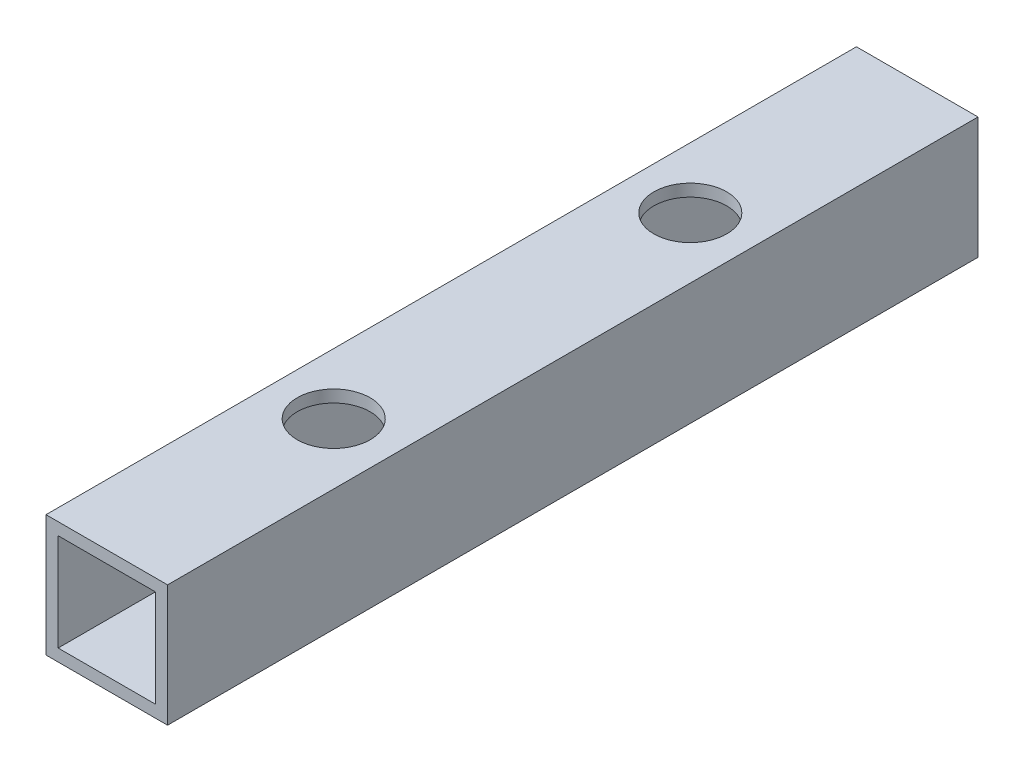
ISO-10303-21;
HEADER;
FILE_DESCRIPTION(('STEP AP214'),'2;1');
FILE_NAME('part.step','',(''),(''),'','','');
FILE_SCHEMA(('AUTOMOTIVE_DESIGN { 1 0 10303 214 1 1 1 1 }'));
ENDSEC;
DATA;
#1=APPLICATION_CONTEXT('core data for automotive mechanical design processes');
#2=APPLICATION_PROTOCOL_DEFINITION('international standard','automotive_design',2000,#1);
#3=PRODUCT_CONTEXT('',#1,'mechanical');
#4=PRODUCT('Part','Part','',(#3));
#5=PRODUCT_RELATED_PRODUCT_CATEGORY('part','',(#4));
#6=PRODUCT_DEFINITION_FORMATION('','',#4);
#7=PRODUCT_DEFINITION_CONTEXT('part definition',#1,'design');
#8=PRODUCT_DEFINITION('design','',#6,#7);
#9=PRODUCT_DEFINITION_SHAPE('','',#8);
#10=(LENGTH_UNIT() NAMED_UNIT(*) SI_UNIT(.MILLI.,.METRE.));
#11=(NAMED_UNIT(*) PLANE_ANGLE_UNIT() SI_UNIT($,.RADIAN.));
#12=(NAMED_UNIT(*) SI_UNIT($,.STERADIAN.) SOLID_ANGLE_UNIT());
#13=UNCERTAINTY_MEASURE_WITH_UNIT(LENGTH_MEASURE(1.E-05),#10,'distance_accuracy_value','');
#14=(GEOMETRIC_REPRESENTATION_CONTEXT(3) GLOBAL_UNCERTAINTY_ASSIGNED_CONTEXT((#13)) GLOBAL_UNIT_ASSIGNED_CONTEXT((#10,
#11,#12)) REPRESENTATION_CONTEXT('',''));
#15=CARTESIAN_POINT('',(0.,0.,0.));
#16=DIRECTION('',(0.,0.,1.));
#17=DIRECTION('',(1.,0.,0.));
#18=AXIS2_PLACEMENT_3D('',#15,#16,#17);
#19=CARTESIAN_POINT('',(0.,0.,100.));
#20=DIRECTION('',(0.,0.,1.));
#21=DIRECTION('',(1.,0.,0.));
#22=AXIS2_PLACEMENT_3D('',#19,#20,#21);
#23=PLANE('',#22);
#24=DIRECTION('',(0.,1.,0.));
#25=VECTOR('',#24,1.);
#26=CARTESIAN_POINT('',(7.5,7.5,100.));
#27=LINE('',#26,#25);
#28=CARTESIAN_POINT('',(7.5,-7.5,100.));
#29=VERTEX_POINT('',#28);
#30=CARTESIAN_POINT('',(7.5,7.5,100.));
#31=VERTEX_POINT('',#30);
#32=EDGE_CURVE('E138',#29,#31,#27,.T.);
#33=ORIENTED_EDGE('',*,*,#32,.T.);
#34=DIRECTION('',(-1.,0.,0.));
#35=VECTOR('',#34,1.);
#36=CARTESIAN_POINT('',(-7.5,7.5,100.));
#37=LINE('',#36,#35);
#38=CARTESIAN_POINT('',(-7.5,7.5,100.));
#39=VERTEX_POINT('',#38);
#40=EDGE_CURVE('E141',#31,#39,#37,.T.);
#41=ORIENTED_EDGE('',*,*,#40,.T.);
#42=DIRECTION('',(0.,-1.,0.));
#43=VECTOR('',#42,1.);
#44=CARTESIAN_POINT('',(-7.5,7.5,100.));
#45=LINE('',#44,#43);
#46=CARTESIAN_POINT('',(-7.5,-7.5,100.));
#47=VERTEX_POINT('',#46);
#48=EDGE_CURVE('E144',#39,#47,#45,.T.);
#49=ORIENTED_EDGE('',*,*,#48,.T.);
#50=DIRECTION('',(1.,0.,0.));
#51=VECTOR('',#50,1.);
#52=CARTESIAN_POINT('',(-7.5,-7.5,100.));
#53=LINE('',#52,#51);
#54=EDGE_CURVE('E146',#47,#29,#53,.T.);
#55=ORIENTED_EDGE('',*,*,#54,.T.);
#56=EDGE_LOOP('',(#33,#41,#49,#55));
#57=FACE_BOUND('',#56,.T.);
#58=DIRECTION('',(-1.,0.,0.));
#59=VECTOR('',#58,1.);
#60=CARTESIAN_POINT('',(-6.,6.,100.));
#61=LINE('',#60,#59);
#62=CARTESIAN_POINT('',(6.,6.,100.));
#63=VERTEX_POINT('',#62);
#64=CARTESIAN_POINT('',(-6.,6.,100.));
#65=VERTEX_POINT('',#64);
#66=EDGE_CURVE('E108',#63,#65,#61,.T.);
#67=ORIENTED_EDGE('',*,*,#66,.F.);
#68=DIRECTION('',(0.,1.,0.));
#69=VECTOR('',#68,1.);
#70=CARTESIAN_POINT('',(6.,6.,100.));
#71=LINE('',#70,#69);
#72=CARTESIAN_POINT('',(6.,-6.,100.));
#73=VERTEX_POINT('',#72);
#74=EDGE_CURVE('E100',#73,#63,#71,.T.);
#75=ORIENTED_EDGE('',*,*,#74,.F.);
#76=DIRECTION('',(1.,0.,0.));
#77=VECTOR('',#76,1.);
#78=CARTESIAN_POINT('',(-6.,-6.,100.));
#79=LINE('',#78,#77);
#80=CARTESIAN_POINT('',(-6.,-6.,100.));
#81=VERTEX_POINT('',#80);
#82=EDGE_CURVE('E122',#81,#73,#79,.T.);
#83=ORIENTED_EDGE('',*,*,#82,.F.);
#84=DIRECTION('',(0.,-1.,0.));
#85=VECTOR('',#84,1.);
#86=CARTESIAN_POINT('',(-6.,6.,100.));
#87=LINE('',#86,#85);
#88=EDGE_CURVE('E120',#65,#81,#87,.T.);
#89=ORIENTED_EDGE('',*,*,#88,.F.);
#90=EDGE_LOOP('',(#67,#75,#83,#89));
#91=FACE_BOUND('',#90,.T.);
#92=ADVANCED_FACE('F33',(#57,#91),#23,.T.);
#93=CARTESIAN_POINT('',(0.,0.,0.));
#94=DIRECTION('',(0.,0.,1.));
#95=DIRECTION('',(1.,0.,0.));
#96=AXIS2_PLACEMENT_3D('',#93,#94,#95);
#97=PLANE('',#96);
#98=DIRECTION('',(0.,1.,0.));
#99=VECTOR('',#98,1.);
#100=CARTESIAN_POINT('',(7.5,7.5,0.));
#101=LINE('',#100,#99);
#102=CARTESIAN_POINT('',(7.5,-7.5,0.));
#103=VERTEX_POINT('',#102);
#104=CARTESIAN_POINT('',(7.5,7.5,0.));
#105=VERTEX_POINT('',#104);
#106=EDGE_CURVE('E116',#103,#105,#101,.T.);
#107=ORIENTED_EDGE('',*,*,#106,.F.);
#108=DIRECTION('',(1.,0.,0.));
#109=VECTOR('',#108,1.);
#110=CARTESIAN_POINT('',(-7.5,-7.5,0.));
#111=LINE('',#110,#109);
#112=CARTESIAN_POINT('',(-7.5,-7.5,0.));
#113=VERTEX_POINT('',#112);
#114=EDGE_CURVE('E142',#113,#103,#111,.T.);
#115=ORIENTED_EDGE('',*,*,#114,.F.);
#116=DIRECTION('',(0.,-1.,0.));
#117=VECTOR('',#116,1.);
#118=CARTESIAN_POINT('',(-7.5,7.5,0.));
#119=LINE('',#118,#117);
#120=CARTESIAN_POINT('',(-7.5,7.5,0.));
#121=VERTEX_POINT('',#120);
#122=EDGE_CURVE('E153',#121,#113,#119,.T.);
#123=ORIENTED_EDGE('',*,*,#122,.F.);
#124=DIRECTION('',(-1.,0.,0.));
#125=VECTOR('',#124,1.);
#126=CARTESIAN_POINT('',(-7.5,7.5,0.));
#127=LINE('',#126,#125);
#128=EDGE_CURVE('E151',#105,#121,#127,.T.);
#129=ORIENTED_EDGE('',*,*,#128,.F.);
#130=EDGE_LOOP('',(#107,#115,#123,#129));
#131=FACE_BOUND('',#130,.T.);
#132=DIRECTION('',(0.,1.,0.));
#133=VECTOR('',#132,1.);
#134=CARTESIAN_POINT('',(6.,6.,0.));
#135=LINE('',#134,#133);
#136=CARTESIAN_POINT('',(6.,-6.,0.));
#137=VERTEX_POINT('',#136);
#138=CARTESIAN_POINT('',(6.,6.,0.));
#139=VERTEX_POINT('',#138);
#140=EDGE_CURVE('E58',#137,#139,#135,.T.);
#141=ORIENTED_EDGE('',*,*,#140,.T.);
#142=DIRECTION('',(-1.,0.,0.));
#143=VECTOR('',#142,1.);
#144=CARTESIAN_POINT('',(-6.,6.,0.));
#145=LINE('',#144,#143);
#146=CARTESIAN_POINT('',(-6.,6.,0.));
#147=VERTEX_POINT('',#146);
#148=EDGE_CURVE('E115',#139,#147,#145,.T.);
#149=ORIENTED_EDGE('',*,*,#148,.T.);
#150=DIRECTION('',(0.,-1.,0.));
#151=VECTOR('',#150,1.);
#152=CARTESIAN_POINT('',(-6.,6.,0.));
#153=LINE('',#152,#151);
#154=CARTESIAN_POINT('',(-6.,-6.,0.));
#155=VERTEX_POINT('',#154);
#156=EDGE_CURVE('E130',#147,#155,#153,.T.);
#157=ORIENTED_EDGE('',*,*,#156,.T.);
#158=DIRECTION('',(1.,0.,0.));
#159=VECTOR('',#158,1.);
#160=CARTESIAN_POINT('',(-6.,-6.,0.));
#161=LINE('',#160,#159);
#162=EDGE_CURVE('E109',#155,#137,#161,.T.);
#163=ORIENTED_EDGE('',*,*,#162,.T.);
#164=EDGE_LOOP('',(#141,#149,#157,#163));
#165=FACE_BOUND('',#164,.T.);
#166=ADVANCED_FACE('F207',(#131,#165),#97,.F.);
#167=CARTESIAN_POINT('',(7.5,7.5,100.));
#168=DIRECTION('',(-1.,0.,0.));
#169=DIRECTION('',(0.,-1.,0.));
#170=AXIS2_PLACEMENT_3D('',#167,#168,#169);
#171=PLANE('',#170);
#172=ORIENTED_EDGE('',*,*,#106,.T.);
#173=DIRECTION('',(0.,0.,-1.));
#174=VECTOR('',#173,1.);
#175=CARTESIAN_POINT('',(7.5,7.5,100.));
#176=LINE('',#175,#174);
#177=EDGE_CURVE('E11',#31,#105,#176,.T.);
#178=ORIENTED_EDGE('',*,*,#177,.F.);
#179=ORIENTED_EDGE('',*,*,#32,.F.);
#180=DIRECTION('',(0.,0.,-1.));
#181=VECTOR('',#180,1.);
#182=CARTESIAN_POINT('',(7.5,-7.5,100.));
#183=LINE('',#182,#181);
#184=EDGE_CURVE('E148',#29,#103,#183,.T.);
#185=ORIENTED_EDGE('',*,*,#184,.T.);
#186=EDGE_LOOP('',(#172,#178,#179,#185));
#187=FACE_BOUND('',#186,.T.);
#188=ADVANCED_FACE('F35',(#187),#171,.F.);
#189=CARTESIAN_POINT('',(-7.5,7.5,100.));
#190=DIRECTION('',(0.,-1.,0.));
#191=DIRECTION('',(0.,0.,-1.));
#192=AXIS2_PLACEMENT_3D('',#189,#190,#191);
#193=PLANE('',#192);
#194=CARTESIAN_POINT('',(0.,7.5,72.));
#195=DIRECTION('',(0.,1.,0.));
#196=DIRECTION('',(0.,0.,1.));
#197=AXIS2_PLACEMENT_3D('',#194,#195,#196);
#198=CIRCLE('',#197,4.5);
#199=CARTESIAN_POINT('',(0.,7.5,76.5));
#200=VERTEX_POINT('',#199);
#201=EDGE_CURVE('E165',#200,#200,#198,.T.);
#202=ORIENTED_EDGE('',*,*,#201,.F.);
#203=EDGE_LOOP('',(#202));
#204=FACE_BOUND('',#203,.T.);
#205=CARTESIAN_POINT('',(0.,7.5,28.));
#206=DIRECTION('',(0.,1.,0.));
#207=DIRECTION('',(0.,0.,1.));
#208=AXIS2_PLACEMENT_3D('',#205,#206,#207);
#209=CIRCLE('',#208,4.5);
#210=CARTESIAN_POINT('',(0.,7.5,32.5));
#211=VERTEX_POINT('',#210);
#212=EDGE_CURVE('E172',#211,#211,#209,.T.);
#213=ORIENTED_EDGE('',*,*,#212,.F.);
#214=EDGE_LOOP('',(#213));
#215=FACE_BOUND('',#214,.T.);
#216=ORIENTED_EDGE('',*,*,#128,.T.);
#217=DIRECTION('',(0.,0.,-1.));
#218=VECTOR('',#217,1.);
#219=CARTESIAN_POINT('',(-7.5,7.5,100.));
#220=LINE('',#219,#218);
#221=EDGE_CURVE('E42',#39,#121,#220,.T.);
#222=ORIENTED_EDGE('',*,*,#221,.F.);
#223=ORIENTED_EDGE('',*,*,#40,.F.);
#224=ORIENTED_EDGE('',*,*,#177,.T.);
#225=EDGE_LOOP('',(#216,#222,#223,#224));
#226=FACE_BOUND('',#225,.T.);
#227=ADVANCED_FACE('F222',(#204,#215,#226),#193,.F.);
#228=CARTESIAN_POINT('',(-7.5,7.5,100.));
#229=DIRECTION('',(1.,0.,0.));
#230=DIRECTION('',(0.,1.,0.));
#231=AXIS2_PLACEMENT_3D('',#228,#229,#230);
#232=PLANE('',#231);
#233=ORIENTED_EDGE('',*,*,#122,.T.);
#234=DIRECTION('',(0.,0.,-1.));
#235=VECTOR('',#234,1.);
#236=CARTESIAN_POINT('',(-7.5,-7.5,100.));
#237=LINE('',#236,#235);
#238=EDGE_CURVE('E158',#47,#113,#237,.T.);
#239=ORIENTED_EDGE('',*,*,#238,.F.);
#240=ORIENTED_EDGE('',*,*,#48,.F.);
#241=ORIENTED_EDGE('',*,*,#221,.T.);
#242=EDGE_LOOP('',(#233,#239,#240,#241));
#243=FACE_BOUND('',#242,.T.);
#244=ADVANCED_FACE('F220',(#243),#232,.F.);
#245=CARTESIAN_POINT('',(-7.5,-7.5,100.));
#246=DIRECTION('',(0.,1.,0.));
#247=DIRECTION('',(0.,0.,1.));
#248=AXIS2_PLACEMENT_3D('',#245,#246,#247);
#249=PLANE('',#248);
#250=CARTESIAN_POINT('',(0.,-7.5,72.));
#251=DIRECTION('',(0.,1.,0.));
#252=DIRECTION('',(0.,0.,1.));
#253=AXIS2_PLACEMENT_3D('',#250,#251,#252);
#254=CIRCLE('',#253,4.5);
#255=CARTESIAN_POINT('',(0.,-7.5,76.5));
#256=VERTEX_POINT('',#255);
#257=EDGE_CURVE('E128',#256,#256,#254,.T.);
#258=ORIENTED_EDGE('',*,*,#257,.T.);
#259=EDGE_LOOP('',(#258));
#260=FACE_BOUND('',#259,.T.);
#261=CARTESIAN_POINT('',(0.,-7.5,28.));
#262=DIRECTION('',(0.,1.,0.));
#263=DIRECTION('',(0.,0.,1.));
#264=AXIS2_PLACEMENT_3D('',#261,#262,#263);
#265=CIRCLE('',#264,4.5);
#266=CARTESIAN_POINT('',(0.,-7.5,32.5));
#267=VERTEX_POINT('',#266);
#268=EDGE_CURVE('E169',#267,#267,#265,.T.);
#269=ORIENTED_EDGE('',*,*,#268,.T.);
#270=EDGE_LOOP('',(#269));
#271=FACE_BOUND('',#270,.T.);
#272=ORIENTED_EDGE('',*,*,#114,.T.);
#273=ORIENTED_EDGE('',*,*,#184,.F.);
#274=ORIENTED_EDGE('',*,*,#54,.F.);
#275=ORIENTED_EDGE('',*,*,#238,.T.);
#276=EDGE_LOOP('',(#272,#273,#274,#275));
#277=FACE_BOUND('',#276,.T.);
#278=ADVANCED_FACE('F186',(#260,#271,#277),#249,.F.);
#279=CARTESIAN_POINT('',(6.,6.,100.));
#280=DIRECTION('',(-1.,0.,0.));
#281=DIRECTION('',(0.,-1.,0.));
#282=AXIS2_PLACEMENT_3D('',#279,#280,#281);
#283=PLANE('',#282);
#284=ORIENTED_EDGE('',*,*,#140,.F.);
#285=DIRECTION('',(0.,0.,-1.));
#286=VECTOR('',#285,1.);
#287=CARTESIAN_POINT('',(6.,-6.,100.));
#288=LINE('',#287,#286);
#289=EDGE_CURVE('E104',#73,#137,#288,.T.);
#290=ORIENTED_EDGE('',*,*,#289,.F.);
#291=ORIENTED_EDGE('',*,*,#74,.T.);
#292=DIRECTION('',(0.,0.,-1.));
#293=VECTOR('',#292,1.);
#294=CARTESIAN_POINT('',(6.,6.,100.));
#295=LINE('',#294,#293);
#296=EDGE_CURVE('E103',#63,#139,#295,.T.);
#297=ORIENTED_EDGE('',*,*,#296,.T.);
#298=EDGE_LOOP('',(#284,#290,#291,#297));
#299=FACE_BOUND('',#298,.T.);
#300=ADVANCED_FACE('F102',(#299),#283,.T.);
#301=CARTESIAN_POINT('',(-6.,6.,100.));
#302=DIRECTION('',(0.,-1.,0.));
#303=DIRECTION('',(0.,0.,-1.));
#304=AXIS2_PLACEMENT_3D('',#301,#302,#303);
#305=PLANE('',#304);
#306=CARTESIAN_POINT('',(0.,6.,72.));
#307=DIRECTION('',(0.,-1.,0.));
#308=DIRECTION('',(0.,0.,-1.));
#309=AXIS2_PLACEMENT_3D('',#306,#307,#308);
#310=CIRCLE('',#309,4.5);
#311=CARTESIAN_POINT('',(0.,6.,67.5));
#312=VERTEX_POINT('',#311);
#313=EDGE_CURVE('E181',#312,#312,#310,.T.);
#314=ORIENTED_EDGE('',*,*,#313,.F.);
#315=EDGE_LOOP('',(#314));
#316=FACE_BOUND('',#315,.T.);
#317=CARTESIAN_POINT('',(0.,6.,28.));
#318=DIRECTION('',(0.,-1.,0.));
#319=DIRECTION('',(0.,0.,-1.));
#320=AXIS2_PLACEMENT_3D('',#317,#318,#319);
#321=CIRCLE('',#320,4.5);
#322=CARTESIAN_POINT('',(0.,6.,23.5));
#323=VERTEX_POINT('',#322);
#324=EDGE_CURVE('E164',#323,#323,#321,.T.);
#325=ORIENTED_EDGE('',*,*,#324,.F.);
#326=EDGE_LOOP('',(#325));
#327=FACE_BOUND('',#326,.T.);
#328=ORIENTED_EDGE('',*,*,#148,.F.);
#329=ORIENTED_EDGE('',*,*,#296,.F.);
#330=ORIENTED_EDGE('',*,*,#66,.T.);
#331=DIRECTION('',(0.,0.,-1.));
#332=VECTOR('',#331,1.);
#333=CARTESIAN_POINT('',(-6.,6.,100.));
#334=LINE('',#333,#332);
#335=EDGE_CURVE('E117',#65,#147,#334,.T.);
#336=ORIENTED_EDGE('',*,*,#335,.T.);
#337=EDGE_LOOP('',(#328,#329,#330,#336));
#338=FACE_BOUND('',#337,.T.);
#339=ADVANCED_FACE('F112',(#316,#327,#338),#305,.T.);
#340=CARTESIAN_POINT('',(-6.,6.,100.));
#341=DIRECTION('',(1.,0.,0.));
#342=DIRECTION('',(0.,1.,0.));
#343=AXIS2_PLACEMENT_3D('',#340,#341,#342);
#344=PLANE('',#343);
#345=ORIENTED_EDGE('',*,*,#156,.F.);
#346=ORIENTED_EDGE('',*,*,#335,.F.);
#347=ORIENTED_EDGE('',*,*,#88,.T.);
#348=DIRECTION('',(0.,0.,-1.));
#349=VECTOR('',#348,1.);
#350=CARTESIAN_POINT('',(-6.,-6.,100.));
#351=LINE('',#350,#349);
#352=EDGE_CURVE('E50',#81,#155,#351,.T.);
#353=ORIENTED_EDGE('',*,*,#352,.T.);
#354=EDGE_LOOP('',(#345,#346,#347,#353));
#355=FACE_BOUND('',#354,.T.);
#356=ADVANCED_FACE('F247',(#355),#344,.T.);
#357=CARTESIAN_POINT('',(-6.,-6.,100.));
#358=DIRECTION('',(0.,1.,0.));
#359=DIRECTION('',(0.,0.,1.));
#360=AXIS2_PLACEMENT_3D('',#357,#358,#359);
#361=PLANE('',#360);
#362=CARTESIAN_POINT('',(0.,-6.,72.));
#363=DIRECTION('',(0.,1.,0.));
#364=DIRECTION('',(0.,0.,1.));
#365=AXIS2_PLACEMENT_3D('',#362,#363,#364);
#366=CIRCLE('',#365,4.5);
#367=CARTESIAN_POINT('',(0.,-6.,76.5));
#368=VERTEX_POINT('',#367);
#369=EDGE_CURVE('E37',#368,#368,#366,.T.);
#370=ORIENTED_EDGE('',*,*,#369,.F.);
#371=EDGE_LOOP('',(#370));
#372=FACE_BOUND('',#371,.T.);
#373=CARTESIAN_POINT('',(0.,-6.,28.));
#374=DIRECTION('',(0.,1.,0.));
#375=DIRECTION('',(0.,0.,1.));
#376=AXIS2_PLACEMENT_3D('',#373,#374,#375);
#377=CIRCLE('',#376,4.5);
#378=CARTESIAN_POINT('',(0.,-6.,32.5));
#379=VERTEX_POINT('',#378);
#380=EDGE_CURVE('E162',#379,#379,#377,.T.);
#381=ORIENTED_EDGE('',*,*,#380,.F.);
#382=EDGE_LOOP('',(#381));
#383=FACE_BOUND('',#382,.T.);
#384=ORIENTED_EDGE('',*,*,#162,.F.);
#385=ORIENTED_EDGE('',*,*,#352,.F.);
#386=ORIENTED_EDGE('',*,*,#82,.T.);
#387=ORIENTED_EDGE('',*,*,#289,.T.);
#388=EDGE_LOOP('',(#384,#385,#386,#387));
#389=FACE_BOUND('',#388,.T.);
#390=ADVANCED_FACE('F202',(#372,#383,#389),#361,.T.);
#391=CARTESIAN_POINT('',(0.,-52.5,28.));
#392=DIRECTION('',(0.,1.,0.));
#393=DIRECTION('',(0.,0.,1.));
#394=AXIS2_PLACEMENT_3D('',#391,#392,#393);
#395=CYLINDRICAL_SURFACE('',#394,4.5);
#396=ORIENTED_EDGE('',*,*,#380,.T.);
#397=EDGE_LOOP('',(#396));
#398=FACE_BOUND('',#397,.T.);
#399=ORIENTED_EDGE('',*,*,#268,.F.);
#400=EDGE_LOOP('',(#399));
#401=FACE_BOUND('',#400,.T.);
#402=ADVANCED_FACE('F192',(#398,#401),#395,.F.);
#403=CARTESIAN_POINT('',(0.,-52.5,72.));
#404=DIRECTION('',(0.,1.,0.));
#405=DIRECTION('',(0.,0.,1.));
#406=AXIS2_PLACEMENT_3D('',#403,#404,#405);
#407=CYLINDRICAL_SURFACE('',#406,4.5);
#408=ORIENTED_EDGE('',*,*,#369,.T.);
#409=EDGE_LOOP('',(#408));
#410=FACE_BOUND('',#409,.T.);
#411=ORIENTED_EDGE('',*,*,#257,.F.);
#412=EDGE_LOOP('',(#411));
#413=FACE_BOUND('',#412,.T.);
#414=ADVANCED_FACE('F189',(#410,#413),#407,.F.);
#415=ORIENTED_EDGE('',*,*,#324,.T.);
#416=EDGE_LOOP('',(#415));
#417=FACE_BOUND('',#416,.T.);
#418=ORIENTED_EDGE('',*,*,#212,.T.);
#419=EDGE_LOOP('',(#418));
#420=FACE_BOUND('',#419,.T.);
#421=ADVANCED_FACE('F191',(#417,#420),#395,.F.);
#422=ORIENTED_EDGE('',*,*,#313,.T.);
#423=EDGE_LOOP('',(#422));
#424=FACE_BOUND('',#423,.T.);
#425=ORIENTED_EDGE('',*,*,#201,.T.);
#426=EDGE_LOOP('',(#425));
#427=FACE_BOUND('',#426,.T.);
#428=ADVANCED_FACE('F195',(#424,#427),#407,.F.);
#429=CLOSED_SHELL('',(#92,#166,#188,#227,#244,#278,#300,#339,#356,#390,#402,#414,#421,#428));
#430=MANIFOLD_SOLID_BREP('B2',#429);
#431=ADVANCED_BREP_SHAPE_REPRESENTATION('',(#18,#430),#14);
#432=SHAPE_DEFINITION_REPRESENTATION(#9,#431);
ENDSEC;
END-ISO-10303-21;
